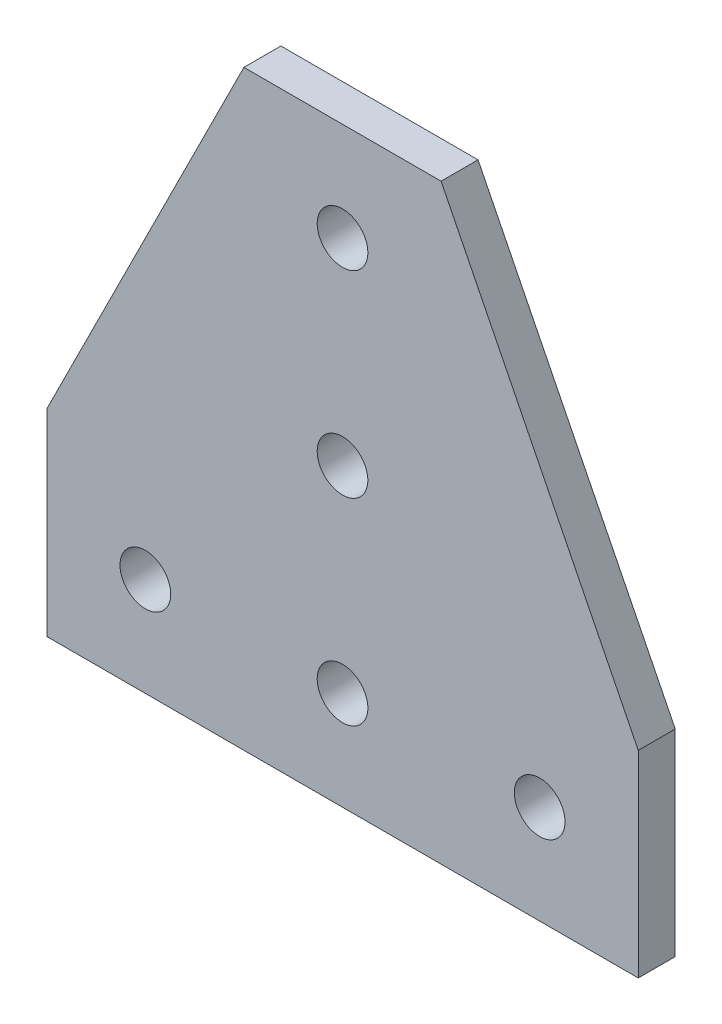
ISO-10303-21;
HEADER;
FILE_DESCRIPTION(('STEP AP214'),'2;1');
FILE_NAME('part.step','',(''),(''),'','','');
FILE_SCHEMA(('AUTOMOTIVE_DESIGN { 1 0 10303 214 1 1 1 1 }'));
ENDSEC;
DATA;
#1=APPLICATION_CONTEXT('core data for automotive mechanical design processes');
#2=APPLICATION_PROTOCOL_DEFINITION('international standard','automotive_design',2000,#1);
#3=PRODUCT_CONTEXT('',#1,'mechanical');
#4=PRODUCT('Part','Part','',(#3));
#5=PRODUCT_RELATED_PRODUCT_CATEGORY('part','',(#4));
#6=PRODUCT_DEFINITION_FORMATION('','',#4);
#7=PRODUCT_DEFINITION_CONTEXT('part definition',#1,'design');
#8=PRODUCT_DEFINITION('design','',#6,#7);
#9=PRODUCT_DEFINITION_SHAPE('','',#8);
#10=(LENGTH_UNIT() NAMED_UNIT(*) SI_UNIT(.MILLI.,.METRE.));
#11=(NAMED_UNIT(*) PLANE_ANGLE_UNIT() SI_UNIT($,.RADIAN.));
#12=(NAMED_UNIT(*) SI_UNIT($,.STERADIAN.) SOLID_ANGLE_UNIT());
#13=UNCERTAINTY_MEASURE_WITH_UNIT(LENGTH_MEASURE(1.E-05),#10,'distance_accuracy_value','');
#14=(GEOMETRIC_REPRESENTATION_CONTEXT(3) GLOBAL_UNCERTAINTY_ASSIGNED_CONTEXT((#13)) GLOBAL_UNIT_ASSIGNED_CONTEXT((#10,
#11,#12)) REPRESENTATION_CONTEXT('',''));
#15=CARTESIAN_POINT('',(0.,0.,0.));
#16=DIRECTION('',(0.,0.,1.));
#17=DIRECTION('',(1.,0.,0.));
#18=AXIS2_PLACEMENT_3D('',#15,#16,#17);
#19=CARTESIAN_POINT('',(-12.7,-25.4,-4.7625));
#20=DIRECTION('',(-0.894427190999916,0.447213595499958,0.));
#21=DIRECTION('',(-0.447213595499958,-0.894427190999916,0.));
#22=AXIS2_PLACEMENT_3D('',#19,#20,#21);
#23=PLANE('',#22);
#24=DIRECTION('',(-0.447213595499958,-0.894427190999916,0.));
#25=VECTOR('',#24,1.);
#26=CARTESIAN_POINT('',(-12.7,-25.4,0.));
#27=LINE('',#26,#25);
#28=CARTESIAN_POINT('',(12.7,25.4,0.));
#29=VERTEX_POINT('',#28);
#30=CARTESIAN_POINT('',(-12.7,-25.4,0.));
#31=VERTEX_POINT('',#30);
#32=EDGE_CURVE('E124',#29,#31,#27,.T.);
#33=ORIENTED_EDGE('',*,*,#32,.F.);
#34=DIRECTION('',(0.,0.,1.));
#35=VECTOR('',#34,1.);
#36=CARTESIAN_POINT('',(12.7,25.4,-4.7625));
#37=LINE('',#36,#35);
#38=CARTESIAN_POINT('',(12.7,25.4,-4.7625));
#39=VERTEX_POINT('',#38);
#40=EDGE_CURVE('E11',#39,#29,#37,.T.);
#41=ORIENTED_EDGE('',*,*,#40,.F.);
#42=DIRECTION('',(-0.447213595499958,-0.894427190999916,0.));
#43=VECTOR('',#42,1.);
#44=CARTESIAN_POINT('',(-12.7,-25.4,-4.7625));
#45=LINE('',#44,#43);
#46=CARTESIAN_POINT('',(-12.7,-25.4,-4.7625));
#47=VERTEX_POINT('',#46);
#48=EDGE_CURVE('E116',#39,#47,#45,.T.);
#49=ORIENTED_EDGE('',*,*,#48,.T.);
#50=DIRECTION('',(0.,0.,1.));
#51=VECTOR('',#50,1.);
#52=CARTESIAN_POINT('',(-12.7,-25.4,-4.7625));
#53=LINE('',#52,#51);
#54=EDGE_CURVE('E33',#47,#31,#53,.T.);
#55=ORIENTED_EDGE('',*,*,#54,.T.);
#56=EDGE_LOOP('',(#33,#41,#49,#55));
#57=FACE_BOUND('',#56,.T.);
#58=ADVANCED_FACE('F30',(#57),#23,.T.);
#59=CARTESIAN_POINT('',(12.7,25.4,-4.7625));
#60=DIRECTION('',(0.,1.,0.));
#61=DIRECTION('',(0.,0.,1.));
#62=AXIS2_PLACEMENT_3D('',#59,#60,#61);
#63=PLANE('',#62);
#64=DIRECTION('',(-1.,0.,0.));
#65=VECTOR('',#64,1.);
#66=CARTESIAN_POINT('',(12.7,25.4,0.));
#67=LINE('',#66,#65);
#68=CARTESIAN_POINT('',(38.1,25.4,0.));
#69=VERTEX_POINT('',#68);
#70=EDGE_CURVE('E119',#69,#29,#67,.T.);
#71=ORIENTED_EDGE('',*,*,#70,.F.);
#72=DIRECTION('',(0.,0.,1.));
#73=VECTOR('',#72,1.);
#74=CARTESIAN_POINT('',(38.1,25.4,-4.7625));
#75=LINE('',#74,#73);
#76=CARTESIAN_POINT('',(38.1,25.4,-4.7625));
#77=VERTEX_POINT('',#76);
#78=EDGE_CURVE('E112',#77,#69,#75,.T.);
#79=ORIENTED_EDGE('',*,*,#78,.F.);
#80=DIRECTION('',(-1.,0.,0.));
#81=VECTOR('',#80,1.);
#82=CARTESIAN_POINT('',(12.7,25.4,-4.7625));
#83=LINE('',#82,#81);
#84=EDGE_CURVE('E102',#77,#39,#83,.T.);
#85=ORIENTED_EDGE('',*,*,#84,.T.);
#86=ORIENTED_EDGE('',*,*,#40,.T.);
#87=EDGE_LOOP('',(#71,#79,#85,#86));
#88=FACE_BOUND('',#87,.T.);
#89=ADVANCED_FACE('F136',(#88),#63,.T.);
#90=CARTESIAN_POINT('',(25.4,-50.8,-4.7625));
#91=DIRECTION('',(0.,-1.,0.));
#92=DIRECTION('',(1.,0.,0.));
#93=AXIS2_PLACEMENT_3D('',#90,#91,#92);
#94=PLANE('',#93);
#95=DIRECTION('',(1.,0.,0.));
#96=VECTOR('',#95,1.);
#97=CARTESIAN_POINT('',(25.4,-50.8,0.));
#98=LINE('',#97,#96);
#99=CARTESIAN_POINT('',(-12.7,-50.8,0.));
#100=VERTEX_POINT('',#99);
#101=CARTESIAN_POINT('',(63.5,-50.8,0.));
#102=VERTEX_POINT('',#101);
#103=EDGE_CURVE('E130',#100,#102,#98,.T.);
#104=ORIENTED_EDGE('',*,*,#103,.F.);
#105=DIRECTION('',(0.,0.,1.));
#106=VECTOR('',#105,1.);
#107=CARTESIAN_POINT('',(-12.7,-50.8,-4.7625));
#108=LINE('',#107,#106);
#109=CARTESIAN_POINT('',(-12.7,-50.8,-4.7625));
#110=VERTEX_POINT('',#109);
#111=EDGE_CURVE('E39',#110,#100,#108,.T.);
#112=ORIENTED_EDGE('',*,*,#111,.F.);
#113=DIRECTION('',(1.,0.,0.));
#114=VECTOR('',#113,1.);
#115=CARTESIAN_POINT('',(25.4,-50.8,-4.7625));
#116=LINE('',#115,#114);
#117=CARTESIAN_POINT('',(63.5,-50.8,-4.7625));
#118=VERTEX_POINT('',#117);
#119=EDGE_CURVE('E121',#110,#118,#116,.T.);
#120=ORIENTED_EDGE('',*,*,#119,.T.);
#121=DIRECTION('',(0.,0.,1.));
#122=VECTOR('',#121,1.);
#123=CARTESIAN_POINT('',(63.5,-50.8,-4.7625));
#124=LINE('',#123,#122);
#125=EDGE_CURVE('E95',#118,#102,#124,.T.);
#126=ORIENTED_EDGE('',*,*,#125,.T.);
#127=EDGE_LOOP('',(#104,#112,#120,#126));
#128=FACE_BOUND('',#127,.T.);
#129=ADVANCED_FACE('F209',(#128),#94,.T.);
#130=CARTESIAN_POINT('',(-12.7,-50.8,-4.7625));
#131=DIRECTION('',(-1.,0.,0.));
#132=DIRECTION('',(0.,0.,1.));
#133=AXIS2_PLACEMENT_3D('',#130,#131,#132);
#134=PLANE('',#133);
#135=DIRECTION('',(0.,-1.,0.));
#136=VECTOR('',#135,1.);
#137=CARTESIAN_POINT('',(-12.7,-50.8,0.));
#138=LINE('',#137,#136);
#139=EDGE_CURVE('E127',#31,#100,#138,.T.);
#140=ORIENTED_EDGE('',*,*,#139,.F.);
#141=ORIENTED_EDGE('',*,*,#54,.F.);
#142=DIRECTION('',(0.,-1.,0.));
#143=VECTOR('',#142,1.);
#144=CARTESIAN_POINT('',(-12.7,-50.8,-4.7625));
#145=LINE('',#144,#143);
#146=EDGE_CURVE('E118',#47,#110,#145,.T.);
#147=ORIENTED_EDGE('',*,*,#146,.T.);
#148=ORIENTED_EDGE('',*,*,#111,.T.);
#149=EDGE_LOOP('',(#140,#141,#147,#148));
#150=FACE_BOUND('',#149,.T.);
#151=ADVANCED_FACE('F133',(#150),#134,.T.);
#152=CARTESIAN_POINT('',(12.7,25.4,-4.7625));
#153=DIRECTION('',(0.,0.,-1.));
#154=DIRECTION('',(-1.,0.,0.));
#155=AXIS2_PLACEMENT_3D('',#152,#153,#154);
#156=PLANE('',#155);
#157=CARTESIAN_POINT('',(0.,-38.1,-4.7625));
#158=DIRECTION('',(0.,0.,-1.));
#159=DIRECTION('',(-1.,0.,0.));
#160=AXIS2_PLACEMENT_3D('',#157,#158,#159);
#161=CIRCLE('',#160,3.2639);
#162=CARTESIAN_POINT('',(-3.2639,-38.1,-4.7625));
#163=VERTEX_POINT('',#162);
#164=EDGE_CURVE('E165',#163,#163,#161,.T.);
#165=ORIENTED_EDGE('',*,*,#164,.F.);
#166=EDGE_LOOP('',(#165));
#167=FACE_BOUND('',#166,.T.);
#168=CARTESIAN_POINT('',(50.8,-38.1,-4.7625));
#169=DIRECTION('',(0.,0.,-1.));
#170=DIRECTION('',(-1.,0.,0.));
#171=AXIS2_PLACEMENT_3D('',#168,#169,#170);
#172=CIRCLE('',#171,3.2639);
#173=CARTESIAN_POINT('',(47.5361,-38.1,-4.7625));
#174=VERTEX_POINT('',#173);
#175=EDGE_CURVE('E159',#174,#174,#172,.T.);
#176=ORIENTED_EDGE('',*,*,#175,.F.);
#177=EDGE_LOOP('',(#176));
#178=FACE_BOUND('',#177,.T.);
#179=CARTESIAN_POINT('',(25.4,12.7,-4.7625));
#180=DIRECTION('',(0.,0.,-1.));
#181=DIRECTION('',(-1.,0.,0.));
#182=AXIS2_PLACEMENT_3D('',#179,#180,#181);
#183=CIRCLE('',#182,3.2639);
#184=CARTESIAN_POINT('',(22.1361,12.7,-4.7625));
#185=VERTEX_POINT('',#184);
#186=EDGE_CURVE('E153',#185,#185,#183,.T.);
#187=ORIENTED_EDGE('',*,*,#186,.F.);
#188=EDGE_LOOP('',(#187));
#189=FACE_BOUND('',#188,.T.);
#190=CARTESIAN_POINT('',(25.4,-12.7,-4.7625));
#191=DIRECTION('',(0.,0.,-1.));
#192=DIRECTION('',(-1.,0.,0.));
#193=AXIS2_PLACEMENT_3D('',#190,#191,#192);
#194=CIRCLE('',#193,3.2639);
#195=CARTESIAN_POINT('',(22.1361,-12.7,-4.7625));
#196=VERTEX_POINT('',#195);
#197=EDGE_CURVE('E147',#196,#196,#194,.T.);
#198=ORIENTED_EDGE('',*,*,#197,.F.);
#199=EDGE_LOOP('',(#198));
#200=FACE_BOUND('',#199,.T.);
#201=CARTESIAN_POINT('',(25.4,-38.1,-4.7625));
#202=DIRECTION('',(0.,0.,-1.));
#203=DIRECTION('',(-1.,0.,0.));
#204=AXIS2_PLACEMENT_3D('',#201,#202,#203);
#205=CIRCLE('',#204,3.2639);
#206=CARTESIAN_POINT('',(22.1361,-38.1,-4.7625));
#207=VERTEX_POINT('',#206);
#208=EDGE_CURVE('E141',#207,#207,#205,.T.);
#209=ORIENTED_EDGE('',*,*,#208,.F.);
#210=EDGE_LOOP('',(#209));
#211=FACE_BOUND('',#210,.T.);
#212=ORIENTED_EDGE('',*,*,#48,.F.);
#213=ORIENTED_EDGE('',*,*,#84,.F.);
#214=DIRECTION('',(0.447213595499958,-0.894427190999916,0.));
#215=VECTOR('',#214,1.);
#216=CARTESIAN_POINT('',(63.5,-25.4,-4.7625));
#217=LINE('',#216,#215);
#218=CARTESIAN_POINT('',(63.5,-25.4,-4.7625));
#219=VERTEX_POINT('',#218);
#220=EDGE_CURVE('E98',#77,#219,#217,.T.);
#221=ORIENTED_EDGE('',*,*,#220,.T.);
#222=DIRECTION('',(0.,-1.,0.));
#223=VECTOR('',#222,1.);
#224=CARTESIAN_POINT('',(63.5,-50.8,-4.7625));
#225=LINE('',#224,#223);
#226=EDGE_CURVE('E87',#219,#118,#225,.T.);
#227=ORIENTED_EDGE('',*,*,#226,.T.);
#228=ORIENTED_EDGE('',*,*,#119,.F.);
#229=ORIENTED_EDGE('',*,*,#146,.F.);
#230=EDGE_LOOP('',(#212,#213,#221,#227,#228,#229));
#231=FACE_BOUND('',#230,.T.);
#232=ADVANCED_FACE('F101',(#167,#178,#189,#200,#211,#231),#156,.T.);
#233=CARTESIAN_POINT('',(12.7,25.4,0.));
#234=DIRECTION('',(0.,0.,-1.));
#235=DIRECTION('',(-1.,0.,0.));
#236=AXIS2_PLACEMENT_3D('',#233,#234,#235);
#237=PLANE('',#236);
#238=CARTESIAN_POINT('',(0.,-38.1,0.));
#239=DIRECTION('',(0.,0.,-1.));
#240=DIRECTION('',(-1.,0.,0.));
#241=AXIS2_PLACEMENT_3D('',#238,#239,#240);
#242=CIRCLE('',#241,3.2639);
#243=CARTESIAN_POINT('',(-3.2639,-38.1,0.));
#244=VERTEX_POINT('',#243);
#245=EDGE_CURVE('E162',#244,#244,#242,.T.);
#246=ORIENTED_EDGE('',*,*,#245,.T.);
#247=EDGE_LOOP('',(#246));
#248=FACE_BOUND('',#247,.T.);
#249=CARTESIAN_POINT('',(50.8,-38.1,0.));
#250=DIRECTION('',(0.,0.,-1.));
#251=DIRECTION('',(-1.,0.,0.));
#252=AXIS2_PLACEMENT_3D('',#249,#250,#251);
#253=CIRCLE('',#252,3.2639);
#254=CARTESIAN_POINT('',(47.5361,-38.1,0.));
#255=VERTEX_POINT('',#254);
#256=EDGE_CURVE('E156',#255,#255,#253,.T.);
#257=ORIENTED_EDGE('',*,*,#256,.T.);
#258=EDGE_LOOP('',(#257));
#259=FACE_BOUND('',#258,.T.);
#260=CARTESIAN_POINT('',(25.4,12.7,0.));
#261=DIRECTION('',(0.,0.,-1.));
#262=DIRECTION('',(-1.,0.,0.));
#263=AXIS2_PLACEMENT_3D('',#260,#261,#262);
#264=CIRCLE('',#263,3.2639);
#265=CARTESIAN_POINT('',(22.1361,12.7,0.));
#266=VERTEX_POINT('',#265);
#267=EDGE_CURVE('E150',#266,#266,#264,.T.);
#268=ORIENTED_EDGE('',*,*,#267,.T.);
#269=EDGE_LOOP('',(#268));
#270=FACE_BOUND('',#269,.T.);
#271=CARTESIAN_POINT('',(25.4,-12.7,0.));
#272=DIRECTION('',(0.,0.,-1.));
#273=DIRECTION('',(-1.,0.,0.));
#274=AXIS2_PLACEMENT_3D('',#271,#272,#273);
#275=CIRCLE('',#274,3.2639);
#276=CARTESIAN_POINT('',(22.1361,-12.7,0.));
#277=VERTEX_POINT('',#276);
#278=EDGE_CURVE('E144',#277,#277,#275,.T.);
#279=ORIENTED_EDGE('',*,*,#278,.T.);
#280=EDGE_LOOP('',(#279));
#281=FACE_BOUND('',#280,.T.);
#282=CARTESIAN_POINT('',(25.4,-38.1,0.));
#283=DIRECTION('',(0.,0.,-1.));
#284=DIRECTION('',(-1.,0.,0.));
#285=AXIS2_PLACEMENT_3D('',#282,#283,#284);
#286=CIRCLE('',#285,3.2639);
#287=CARTESIAN_POINT('',(22.1361,-38.1,0.));
#288=VERTEX_POINT('',#287);
#289=EDGE_CURVE('E139',#288,#288,#286,.T.);
#290=ORIENTED_EDGE('',*,*,#289,.T.);
#291=EDGE_LOOP('',(#290));
#292=FACE_BOUND('',#291,.T.);
#293=ORIENTED_EDGE('',*,*,#32,.T.);
#294=ORIENTED_EDGE('',*,*,#139,.T.);
#295=ORIENTED_EDGE('',*,*,#103,.T.);
#296=DIRECTION('',(0.,-1.,0.));
#297=VECTOR('',#296,1.);
#298=CARTESIAN_POINT('',(63.5,-50.8,0.));
#299=LINE('',#298,#297);
#300=CARTESIAN_POINT('',(63.5,-25.4,0.));
#301=VERTEX_POINT('',#300);
#302=EDGE_CURVE('E106',#301,#102,#299,.T.);
#303=ORIENTED_EDGE('',*,*,#302,.F.);
#304=DIRECTION('',(0.447213595499958,-0.894427190999916,0.));
#305=VECTOR('',#304,1.);
#306=CARTESIAN_POINT('',(63.5,-25.4,0.));
#307=LINE('',#306,#305);
#308=EDGE_CURVE('E110',#69,#301,#307,.T.);
#309=ORIENTED_EDGE('',*,*,#308,.F.);
#310=ORIENTED_EDGE('',*,*,#70,.T.);
#311=EDGE_LOOP('',(#293,#294,#295,#303,#309,#310));
#312=FACE_BOUND('',#311,.T.);
#313=ADVANCED_FACE('F135',(#248,#259,#270,#281,#292,#312),#237,.F.);
#314=CARTESIAN_POINT('',(63.5,-25.4,-4.7625));
#315=DIRECTION('',(0.894427190999916,0.447213595499958,0.));
#316=DIRECTION('',(0.447213595499958,-0.894427190999916,0.));
#317=AXIS2_PLACEMENT_3D('',#314,#315,#316);
#318=PLANE('',#317);
#319=ORIENTED_EDGE('',*,*,#308,.T.);
#320=DIRECTION('',(0.,0.,1.));
#321=VECTOR('',#320,1.);
#322=CARTESIAN_POINT('',(63.5,-25.4,-4.7625));
#323=LINE('',#322,#321);
#324=EDGE_CURVE('E92',#219,#301,#323,.T.);
#325=ORIENTED_EDGE('',*,*,#324,.F.);
#326=ORIENTED_EDGE('',*,*,#220,.F.);
#327=ORIENTED_EDGE('',*,*,#78,.T.);
#328=EDGE_LOOP('',(#319,#325,#326,#327));
#329=FACE_BOUND('',#328,.T.);
#330=ADVANCED_FACE('F108',(#329),#318,.T.);
#331=CARTESIAN_POINT('',(63.5,-50.8,-4.7625));
#332=DIRECTION('',(1.,0.,0.));
#333=DIRECTION('',(0.,0.,1.));
#334=AXIS2_PLACEMENT_3D('',#331,#332,#333);
#335=PLANE('',#334);
#336=ORIENTED_EDGE('',*,*,#302,.T.);
#337=ORIENTED_EDGE('',*,*,#125,.F.);
#338=ORIENTED_EDGE('',*,*,#226,.F.);
#339=ORIENTED_EDGE('',*,*,#324,.T.);
#340=EDGE_LOOP('',(#336,#337,#338,#339));
#341=FACE_BOUND('',#340,.T.);
#342=ADVANCED_FACE('F90',(#341),#335,.T.);
#343=CARTESIAN_POINT('',(25.4,-38.1,0.));
#344=DIRECTION('',(0.,0.,-1.));
#345=DIRECTION('',(-1.,0.,0.));
#346=AXIS2_PLACEMENT_3D('',#343,#344,#345);
#347=CYLINDRICAL_SURFACE('',#346,3.2639);
#348=ORIENTED_EDGE('',*,*,#289,.F.);
#349=EDGE_LOOP('',(#348));
#350=FACE_BOUND('',#349,.T.);
#351=ORIENTED_EDGE('',*,*,#208,.T.);
#352=EDGE_LOOP('',(#351));
#353=FACE_BOUND('',#352,.T.);
#354=ADVANCED_FACE('F191',(#350,#353),#347,.F.);
#355=CARTESIAN_POINT('',(25.4,-12.7,0.));
#356=DIRECTION('',(0.,0.,-1.));
#357=DIRECTION('',(-1.,0.,0.));
#358=AXIS2_PLACEMENT_3D('',#355,#356,#357);
#359=CYLINDRICAL_SURFACE('',#358,3.2639);
#360=ORIENTED_EDGE('',*,*,#278,.F.);
#361=EDGE_LOOP('',(#360));
#362=FACE_BOUND('',#361,.T.);
#363=ORIENTED_EDGE('',*,*,#197,.T.);
#364=EDGE_LOOP('',(#363));
#365=FACE_BOUND('',#364,.T.);
#366=ADVANCED_FACE('F193',(#362,#365),#359,.F.);
#367=CARTESIAN_POINT('',(25.4,12.7,0.));
#368=DIRECTION('',(0.,0.,-1.));
#369=DIRECTION('',(-1.,0.,0.));
#370=AXIS2_PLACEMENT_3D('',#367,#368,#369);
#371=CYLINDRICAL_SURFACE('',#370,3.2639);
#372=ORIENTED_EDGE('',*,*,#267,.F.);
#373=EDGE_LOOP('',(#372));
#374=FACE_BOUND('',#373,.T.);
#375=ORIENTED_EDGE('',*,*,#186,.T.);
#376=EDGE_LOOP('',(#375));
#377=FACE_BOUND('',#376,.T.);
#378=ADVANCED_FACE('F200',(#374,#377),#371,.F.);
#379=CARTESIAN_POINT('',(50.8,-38.1,0.));
#380=DIRECTION('',(0.,0.,-1.));
#381=DIRECTION('',(-1.,0.,0.));
#382=AXIS2_PLACEMENT_3D('',#379,#380,#381);
#383=CYLINDRICAL_SURFACE('',#382,3.2639);
#384=ORIENTED_EDGE('',*,*,#256,.F.);
#385=EDGE_LOOP('',(#384));
#386=FACE_BOUND('',#385,.T.);
#387=ORIENTED_EDGE('',*,*,#175,.T.);
#388=EDGE_LOOP('',(#387));
#389=FACE_BOUND('',#388,.T.);
#390=ADVANCED_FACE('F176',(#386,#389),#383,.F.);
#391=CARTESIAN_POINT('',(0.,-38.1,0.));
#392=DIRECTION('',(0.,0.,-1.));
#393=DIRECTION('',(-1.,0.,0.));
#394=AXIS2_PLACEMENT_3D('',#391,#392,#393);
#395=CYLINDRICAL_SURFACE('',#394,3.2639);
#396=ORIENTED_EDGE('',*,*,#245,.F.);
#397=EDGE_LOOP('',(#396));
#398=FACE_BOUND('',#397,.T.);
#399=ORIENTED_EDGE('',*,*,#164,.T.);
#400=EDGE_LOOP('',(#399));
#401=FACE_BOUND('',#400,.T.);
#402=ADVANCED_FACE('F173',(#398,#401),#395,.F.);
#403=CLOSED_SHELL('',(#58,#89,#129,#151,#232,#313,#330,#342,#354,#366,#378,#390,#402));
#404=MANIFOLD_SOLID_BREP('B2',#403);
#405=ADVANCED_BREP_SHAPE_REPRESENTATION('',(#18,#404),#14);
#406=SHAPE_DEFINITION_REPRESENTATION(#9,#405);
ENDSEC;
END-ISO-10303-21;
